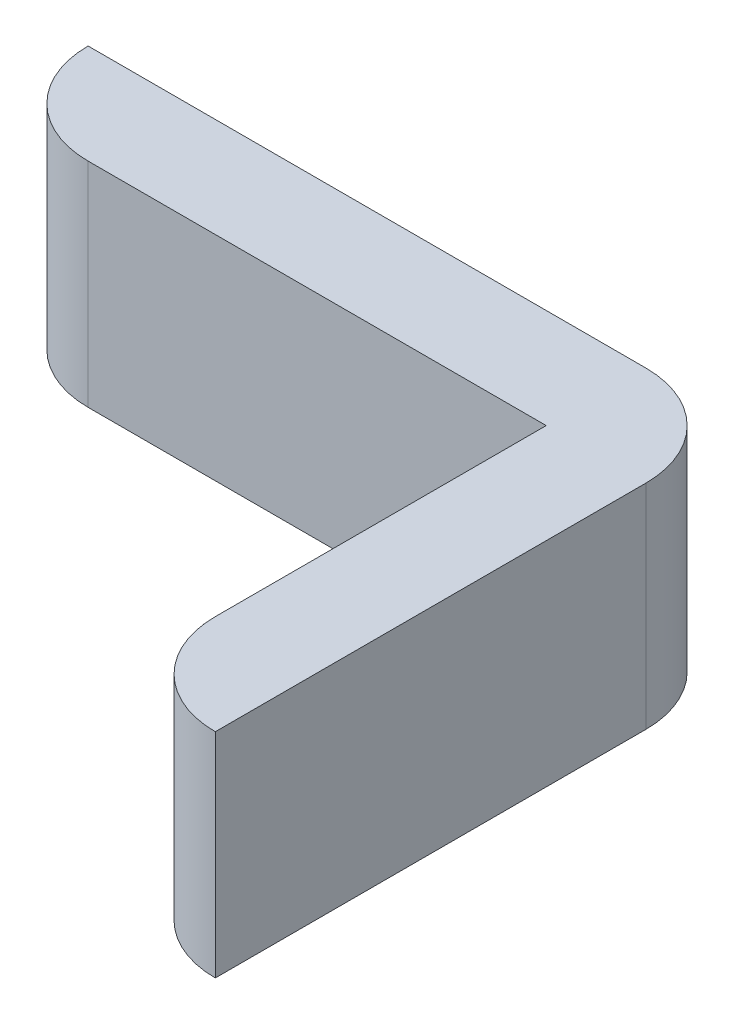
ISO-10303-21;
HEADER;
FILE_DESCRIPTION(('STEP AP214'),'2;1');
FILE_NAME('part.step','',(''),(''),'','','');
FILE_SCHEMA(('AUTOMOTIVE_DESIGN { 1 0 10303 214 1 1 1 1 }'));
ENDSEC;
DATA;
#1=APPLICATION_CONTEXT('core data for automotive mechanical design processes');
#2=APPLICATION_PROTOCOL_DEFINITION('international standard','automotive_design',2000,#1);
#3=PRODUCT_CONTEXT('',#1,'mechanical');
#4=PRODUCT('Part','Part','',(#3));
#5=PRODUCT_RELATED_PRODUCT_CATEGORY('part','',(#4));
#6=PRODUCT_DEFINITION_FORMATION('','',#4);
#7=PRODUCT_DEFINITION_CONTEXT('part definition',#1,'design');
#8=PRODUCT_DEFINITION('design','',#6,#7);
#9=PRODUCT_DEFINITION_SHAPE('','',#8);
#10=(LENGTH_UNIT() NAMED_UNIT(*) SI_UNIT(.MILLI.,.METRE.));
#11=(NAMED_UNIT(*) PLANE_ANGLE_UNIT() SI_UNIT($,.RADIAN.));
#12=(NAMED_UNIT(*) SI_UNIT($,.STERADIAN.) SOLID_ANGLE_UNIT());
#13=UNCERTAINTY_MEASURE_WITH_UNIT(LENGTH_MEASURE(1.E-05),#10,'distance_accuracy_value','');
#14=(GEOMETRIC_REPRESENTATION_CONTEXT(3) GLOBAL_UNCERTAINTY_ASSIGNED_CONTEXT((#13)) GLOBAL_UNIT_ASSIGNED_CONTEXT((#10,
#11,#12)) REPRESENTATION_CONTEXT('',''));
#15=CARTESIAN_POINT('',(0.,0.,0.));
#16=DIRECTION('',(0.,0.,1.));
#17=DIRECTION('',(1.,0.,0.));
#18=AXIS2_PLACEMENT_3D('',#15,#16,#17);
#19=CARTESIAN_POINT('',(-1.0795,-0.9025,1.33));
#20=DIRECTION('',(-1.,0.,0.));
#21=DIRECTION('',(0.,0.,1.));
#22=AXIS2_PLACEMENT_3D('',#19,#20,#21);
#23=PLANE('',#22);
#24=DIRECTION('',(0.,0.,-1.));
#25=VECTOR('',#24,1.);
#26=CARTESIAN_POINT('',(-1.0795,-0.9025,0.));
#27=LINE('',#26,#25);
#28=CARTESIAN_POINT('',(-1.0795,-0.9025,0.25));
#29=VERTEX_POINT('',#28);
#30=CARTESIAN_POINT('',(-1.0795,-0.9025,1.33));
#31=VERTEX_POINT('',#30);
#32=EDGE_CURVE('E129',#29,#31,#27,.F.);
#33=ORIENTED_EDGE('',*,*,#32,.F.);
#34=DIRECTION('',(0.,-1.,0.));
#35=VECTOR('',#34,1.);
#36=CARTESIAN_POINT('',(-1.0795,-0.9025,0.25));
#37=LINE('',#36,#35);
#38=CARTESIAN_POINT('',(-1.0795,-0.3675,0.25));
#39=VERTEX_POINT('',#38);
#40=EDGE_CURVE('E82',#39,#29,#37,.T.);
#41=ORIENTED_EDGE('',*,*,#40,.F.);
#42=DIRECTION('',(0.,0.,-1.));
#43=VECTOR('',#42,1.);
#44=CARTESIAN_POINT('',(-1.0795,-0.3675,0.));
#45=LINE('',#44,#43);
#46=CARTESIAN_POINT('',(-1.0795,-0.3675,1.33));
#47=VERTEX_POINT('',#46);
#48=EDGE_CURVE('E77',#39,#47,#45,.F.);
#49=ORIENTED_EDGE('',*,*,#48,.T.);
#50=DIRECTION('',(0.,-1.,0.));
#51=VECTOR('',#50,1.);
#52=CARTESIAN_POINT('',(-1.0795,-0.9025,1.33));
#53=LINE('',#52,#51);
#54=EDGE_CURVE('E123',#31,#47,#53,.F.);
#55=ORIENTED_EDGE('',*,*,#54,.F.);
#56=EDGE_LOOP('',(#33,#41,#49,#55));
#57=FACE_BOUND('',#56,.T.);
#58=ADVANCED_FACE('F17',(#57),#23,.F.);
#59=CARTESIAN_POINT('',(-1.0795,-0.9025,1.08));
#60=DIRECTION('',(0.,-1.,0.));
#61=DIRECTION('',(0.,0.,-1.));
#62=AXIS2_PLACEMENT_3D('',#59,#60,#61);
#63=CYLINDRICAL_SURFACE('',#62,0.25);
#64=CARTESIAN_POINT('',(-1.0795,-0.3675,1.08));
#65=DIRECTION('',(0.,-1.,0.));
#66=DIRECTION('',(0.,0.,-1.));
#67=AXIS2_PLACEMENT_3D('',#64,#65,#66);
#68=CIRCLE('',#67,0.25);
#69=CARTESIAN_POINT('',(-1.3295,-0.3675,1.08));
#70=VERTEX_POINT('',#69);
#71=EDGE_CURVE('E107',#47,#70,#68,.T.);
#72=ORIENTED_EDGE('',*,*,#71,.T.);
#73=DIRECTION('',(0.,1.,0.));
#74=VECTOR('',#73,1.);
#75=CARTESIAN_POINT('',(-1.3295,-0.9025,1.08));
#76=LINE('',#75,#74);
#77=CARTESIAN_POINT('',(-1.3295,-0.9025,1.08));
#78=VERTEX_POINT('',#77);
#79=EDGE_CURVE('E118',#70,#78,#76,.F.);
#80=ORIENTED_EDGE('',*,*,#79,.T.);
#81=CARTESIAN_POINT('',(-1.0795,-0.9025,1.08));
#82=DIRECTION('',(0.,-1.,0.));
#83=DIRECTION('',(0.,0.,-1.));
#84=AXIS2_PLACEMENT_3D('',#81,#82,#83);
#85=CIRCLE('',#84,0.25);
#86=EDGE_CURVE('E126',#31,#78,#85,.T.);
#87=ORIENTED_EDGE('',*,*,#86,.F.);
#88=ORIENTED_EDGE('',*,*,#54,.T.);
#89=EDGE_LOOP('',(#72,#80,#87,#88));
#90=FACE_BOUND('',#89,.T.);
#91=ADVANCED_FACE('F133',(#90),#63,.T.);
#92=CARTESIAN_POINT('',(-1.3295,-0.9025,0.25));
#93=DIRECTION('',(1.,0.,0.));
#94=DIRECTION('',(0.,0.,-1.));
#95=AXIS2_PLACEMENT_3D('',#92,#93,#94);
#96=PLANE('',#95);
#97=ORIENTED_EDGE('',*,*,#79,.F.);
#98=DIRECTION('',(0.,0.,-1.));
#99=VECTOR('',#98,1.);
#100=CARTESIAN_POINT('',(-1.3295,-0.3675,0.));
#101=LINE('',#100,#99);
#102=CARTESIAN_POINT('',(-1.3295,-0.3675,0.25));
#103=VERTEX_POINT('',#102);
#104=EDGE_CURVE('E102',#70,#103,#101,.T.);
#105=ORIENTED_EDGE('',*,*,#104,.T.);
#106=DIRECTION('',(0.,1.,0.));
#107=VECTOR('',#106,1.);
#108=CARTESIAN_POINT('',(-1.3295,-0.9025,0.25));
#109=LINE('',#108,#107);
#110=CARTESIAN_POINT('',(-1.3295,-0.9025,0.25));
#111=VERTEX_POINT('',#110);
#112=EDGE_CURVE('E115',#103,#111,#109,.F.);
#113=ORIENTED_EDGE('',*,*,#112,.T.);
#114=DIRECTION('',(0.,0.,-1.));
#115=VECTOR('',#114,1.);
#116=CARTESIAN_POINT('',(-1.3295,-0.9025,0.));
#117=LINE('',#116,#115);
#118=EDGE_CURVE('E128',#78,#111,#117,.T.);
#119=ORIENTED_EDGE('',*,*,#118,.F.);
#120=EDGE_LOOP('',(#97,#105,#113,#119));
#121=FACE_BOUND('',#120,.T.);
#122=ADVANCED_FACE('F158',(#121),#96,.F.);
#123=CARTESIAN_POINT('',(-2.4785,-0.9025,0.25));
#124=DIRECTION('',(0.,0.,-1.));
#125=DIRECTION('',(-1.,0.,0.));
#126=AXIS2_PLACEMENT_3D('',#123,#124,#125);
#127=PLANE('',#126);
#128=ORIENTED_EDGE('',*,*,#112,.F.);
#129=DIRECTION('',(1.,0.,0.));
#130=VECTOR('',#129,1.);
#131=CARTESIAN_POINT('',(-2.7285,-0.3675,0.25));
#132=LINE('',#131,#130);
#133=CARTESIAN_POINT('',(-2.4785,-0.3675,0.25));
#134=VERTEX_POINT('',#133);
#135=EDGE_CURVE('E98',#103,#134,#132,.F.);
#136=ORIENTED_EDGE('',*,*,#135,.T.);
#137=DIRECTION('',(0.,-1.,0.));
#138=VECTOR('',#137,1.);
#139=CARTESIAN_POINT('',(-2.4785,-0.9025,0.25));
#140=LINE('',#139,#138);
#141=CARTESIAN_POINT('',(-2.4785,-0.9025,0.25));
#142=VERTEX_POINT('',#141);
#143=EDGE_CURVE('E101',#142,#134,#140,.F.);
#144=ORIENTED_EDGE('',*,*,#143,.F.);
#145=DIRECTION('',(1.,0.,0.));
#146=VECTOR('',#145,1.);
#147=CARTESIAN_POINT('',(-2.7285,-0.9025,0.25));
#148=LINE('',#147,#146);
#149=EDGE_CURVE('E94',#111,#142,#148,.F.);
#150=ORIENTED_EDGE('',*,*,#149,.F.);
#151=EDGE_LOOP('',(#128,#136,#144,#150));
#152=FACE_BOUND('',#151,.T.);
#153=ADVANCED_FACE('F156',(#152),#127,.F.);
#154=CARTESIAN_POINT('',(-1.3295,-0.9025,0.25));
#155=DIRECTION('',(0.,-1.,0.));
#156=DIRECTION('',(0.,0.,-1.));
#157=AXIS2_PLACEMENT_3D('',#154,#155,#156);
#158=CYLINDRICAL_SURFACE('',#157,0.25);
#159=CARTESIAN_POINT('',(-1.3295,-0.3675,0.25));
#160=DIRECTION('',(0.,-1.,0.));
#161=DIRECTION('',(0.,0.,-1.));
#162=AXIS2_PLACEMENT_3D('',#159,#160,#161);
#163=CIRCLE('',#162,0.25);
#164=CARTESIAN_POINT('',(-1.3295,-0.3675,0.));
#165=VERTEX_POINT('',#164);
#166=EDGE_CURVE('E20',#165,#39,#163,.T.);
#167=ORIENTED_EDGE('',*,*,#166,.T.);
#168=ORIENTED_EDGE('',*,*,#40,.T.);
#169=CARTESIAN_POINT('',(-1.3295,-0.9025,0.25));
#170=DIRECTION('',(0.,-1.,0.));
#171=DIRECTION('',(0.,0.,-1.));
#172=AXIS2_PLACEMENT_3D('',#169,#170,#171);
#173=CIRCLE('',#172,0.25);
#174=CARTESIAN_POINT('',(-1.3295,-0.9025,0.));
#175=VERTEX_POINT('',#174);
#176=EDGE_CURVE('E92',#175,#29,#173,.T.);
#177=ORIENTED_EDGE('',*,*,#176,.F.);
#178=DIRECTION('',(0.,1.,0.));
#179=VECTOR('',#178,1.);
#180=CARTESIAN_POINT('',(-1.3295,-0.9025,0.));
#181=LINE('',#180,#179);
#182=EDGE_CURVE('E86',#175,#165,#181,.T.);
#183=ORIENTED_EDGE('',*,*,#182,.T.);
#184=EDGE_LOOP('',(#167,#168,#177,#183));
#185=FACE_BOUND('',#184,.T.);
#186=ADVANCED_FACE('F90',(#185),#158,.T.);
#187=CARTESIAN_POINT('',(-2.7285,-0.3675,0.));
#188=DIRECTION('',(0.,-1.,0.));
#189=DIRECTION('',(0.,0.,-1.));
#190=AXIS2_PLACEMENT_3D('',#187,#188,#189);
#191=PLANE('',#190);
#192=ORIENTED_EDGE('',*,*,#135,.F.);
#193=ORIENTED_EDGE('',*,*,#104,.F.);
#194=ORIENTED_EDGE('',*,*,#71,.F.);
#195=ORIENTED_EDGE('',*,*,#48,.F.);
#196=ORIENTED_EDGE('',*,*,#166,.F.);
#197=DIRECTION('',(1.,0.,0.));
#198=VECTOR('',#197,1.);
#199=CARTESIAN_POINT('',(-1.3295,-0.3675,0.));
#200=LINE('',#199,#198);
#201=CARTESIAN_POINT('',(-2.7285,-0.3675,0.));
#202=VERTEX_POINT('',#201);
#203=EDGE_CURVE('E74',#165,#202,#200,.F.);
#204=ORIENTED_EDGE('',*,*,#203,.T.);
#205=CARTESIAN_POINT('',(-2.4785,-0.3675,0.));
#206=DIRECTION('',(0.,-1.,0.));
#207=DIRECTION('',(0.,0.,-1.));
#208=AXIS2_PLACEMENT_3D('',#205,#206,#207);
#209=CIRCLE('',#208,0.25);
#210=EDGE_CURVE('E114',#134,#202,#209,.T.);
#211=ORIENTED_EDGE('',*,*,#210,.F.);
#212=EDGE_LOOP('',(#192,#193,#194,#195,#196,#204,#211));
#213=FACE_BOUND('',#212,.T.);
#214=ADVANCED_FACE('F72',(#213),#191,.F.);
#215=CARTESIAN_POINT('',(-2.4785,-0.9025,0.));
#216=DIRECTION('',(0.,-1.,0.));
#217=DIRECTION('',(0.,0.,-1.));
#218=AXIS2_PLACEMENT_3D('',#215,#216,#217);
#219=CYLINDRICAL_SURFACE('',#218,0.25);
#220=ORIENTED_EDGE('',*,*,#210,.T.);
#221=DIRECTION('',(0.,1.,0.));
#222=VECTOR('',#221,1.);
#223=CARTESIAN_POINT('',(-2.7285,-0.9025,0.));
#224=LINE('',#223,#222);
#225=CARTESIAN_POINT('',(-2.7285,-0.9025,0.));
#226=VERTEX_POINT('',#225);
#227=EDGE_CURVE('E26',#202,#226,#224,.F.);
#228=ORIENTED_EDGE('',*,*,#227,.T.);
#229=CARTESIAN_POINT('',(-2.4785,-0.9025,0.));
#230=DIRECTION('',(0.,-1.,0.));
#231=DIRECTION('',(0.,0.,-1.));
#232=AXIS2_PLACEMENT_3D('',#229,#230,#231);
#233=CIRCLE('',#232,0.25);
#234=EDGE_CURVE('E34',#142,#226,#233,.T.);
#235=ORIENTED_EDGE('',*,*,#234,.F.);
#236=ORIENTED_EDGE('',*,*,#143,.T.);
#237=EDGE_LOOP('',(#220,#228,#235,#236));
#238=FACE_BOUND('',#237,.T.);
#239=ADVANCED_FACE('F141',(#238),#219,.T.);
#240=CARTESIAN_POINT('',(-2.7285,-0.9025,0.));
#241=DIRECTION('',(0.,-1.,0.));
#242=DIRECTION('',(0.,0.,-1.));
#243=AXIS2_PLACEMENT_3D('',#240,#241,#242);
#244=PLANE('',#243);
#245=ORIENTED_EDGE('',*,*,#149,.T.);
#246=ORIENTED_EDGE('',*,*,#234,.T.);
#247=DIRECTION('',(1.,0.,0.));
#248=VECTOR('',#247,1.);
#249=CARTESIAN_POINT('',(-1.3295,-0.9025,0.));
#250=LINE('',#249,#248);
#251=EDGE_CURVE('E11',#226,#175,#250,.T.);
#252=ORIENTED_EDGE('',*,*,#251,.T.);
#253=ORIENTED_EDGE('',*,*,#176,.T.);
#254=ORIENTED_EDGE('',*,*,#32,.T.);
#255=ORIENTED_EDGE('',*,*,#86,.T.);
#256=ORIENTED_EDGE('',*,*,#118,.T.);
#257=EDGE_LOOP('',(#245,#246,#252,#253,#254,#255,#256));
#258=FACE_BOUND('',#257,.T.);
#259=ADVANCED_FACE('F139',(#258),#244,.T.);
#260=CARTESIAN_POINT('',(-1.3295,-0.9025,0.));
#261=DIRECTION('',(0.,0.,1.));
#262=DIRECTION('',(1.,0.,0.));
#263=AXIS2_PLACEMENT_3D('',#260,#261,#262);
#264=PLANE('',#263);
#265=ORIENTED_EDGE('',*,*,#227,.F.);
#266=ORIENTED_EDGE('',*,*,#203,.F.);
#267=ORIENTED_EDGE('',*,*,#182,.F.);
#268=ORIENTED_EDGE('',*,*,#251,.F.);
#269=EDGE_LOOP('',(#265,#266,#267,#268));
#270=FACE_BOUND('',#269,.T.);
#271=ADVANCED_FACE('F85',(#270),#264,.F.);
#272=CLOSED_SHELL('',(#58,#91,#122,#153,#186,#214,#239,#259,#271));
#273=MANIFOLD_SOLID_BREP('B1',#272);
#274=ADVANCED_BREP_SHAPE_REPRESENTATION('',(#18,#273),#14);
#275=SHAPE_DEFINITION_REPRESENTATION(#9,#274);
ENDSEC;
END-ISO-10303-21;
